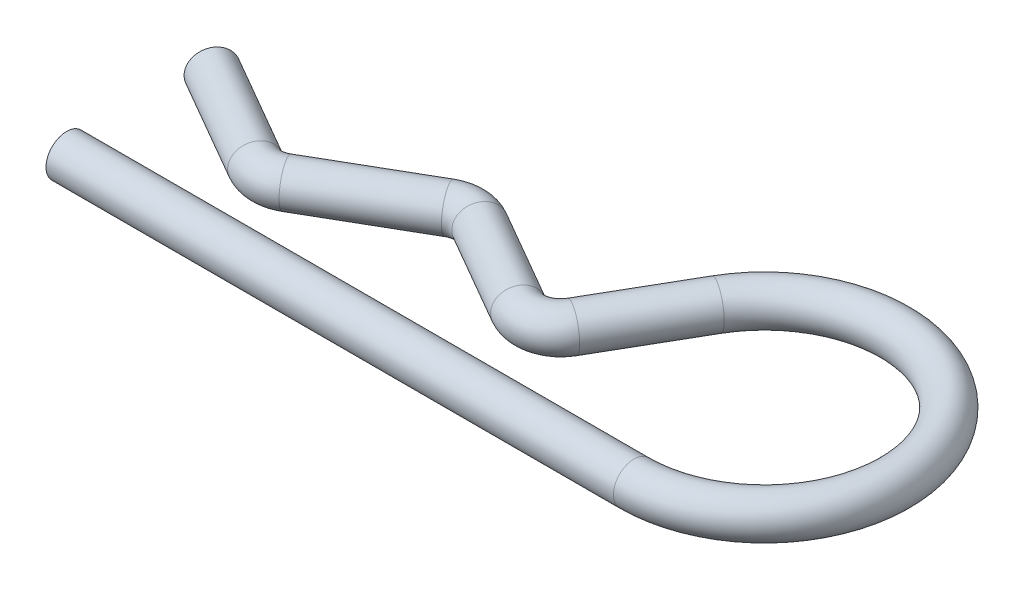
ISO-10303-21;
HEADER;
FILE_DESCRIPTION(('STEP AP214'),'2;1');
FILE_NAME('part.step','',(''),(''),'','','');
FILE_SCHEMA(('AUTOMOTIVE_DESIGN { 1 0 10303 214 1 1 1 1 }'));
ENDSEC;
DATA;
#1=APPLICATION_CONTEXT('core data for automotive mechanical design processes');
#2=APPLICATION_PROTOCOL_DEFINITION('international standard','automotive_design',2000,#1);
#3=PRODUCT_CONTEXT('',#1,'mechanical');
#4=PRODUCT('Part','Part','',(#3));
#5=PRODUCT_RELATED_PRODUCT_CATEGORY('part','',(#4));
#6=PRODUCT_DEFINITION_FORMATION('','',#4);
#7=PRODUCT_DEFINITION_CONTEXT('part definition',#1,'design');
#8=PRODUCT_DEFINITION('design','',#6,#7);
#9=PRODUCT_DEFINITION_SHAPE('','',#8);
#10=(LENGTH_UNIT() NAMED_UNIT(*) SI_UNIT(.MILLI.,.METRE.));
#11=(NAMED_UNIT(*) PLANE_ANGLE_UNIT() SI_UNIT($,.RADIAN.));
#12=(NAMED_UNIT(*) SI_UNIT($,.STERADIAN.) SOLID_ANGLE_UNIT());
#13=UNCERTAINTY_MEASURE_WITH_UNIT(LENGTH_MEASURE(1.E-05),#10,'distance_accuracy_value','');
#14=(GEOMETRIC_REPRESENTATION_CONTEXT(3) GLOBAL_UNCERTAINTY_ASSIGNED_CONTEXT((#13)) GLOBAL_UNIT_ASSIGNED_CONTEXT((#10,
#11,#12)) REPRESENTATION_CONTEXT('',''));
#15=CARTESIAN_POINT('',(0.,0.,0.));
#16=DIRECTION('',(0.,0.,1.));
#17=DIRECTION('',(1.,0.,0.));
#18=AXIS2_PLACEMENT_3D('',#15,#16,#17);
#19=CARTESIAN_POINT('',(-3.625,0.,-2.09289472581241));
#20=DIRECTION('',(-0.866025403784439,0.,-0.5));
#21=DIRECTION('',(-0.5,0.,0.866025403784439));
#22=AXIS2_PLACEMENT_3D('',#19,#20,#21);
#23=CYLINDRICAL_SURFACE('',#22,0.5);
#24=CARTESIAN_POINT('',(-3.625,0.,-2.09289472581241));
#25=DIRECTION('',(-0.866025403784445,0.,-0.499999999999989));
#26=DIRECTION('',(-0.499999999999989,0.,0.866025403784445));
#27=AXIS2_PLACEMENT_3D('',#24,#25,#26);
#28=CIRCLE('',#27,0.5);
#29=CARTESIAN_POINT('',(-3.87500000000001,0.,-1.65988202392018));
#30=VERTEX_POINT('',#29);
#31=EDGE_CURVE('E20',#30,#30,#28,.T.);
#32=ORIENTED_EDGE('',*,*,#31,.T.);
#33=EDGE_LOOP('',(#32));
#34=FACE_BOUND('',#33,.T.);
#35=CARTESIAN_POINT('',(-6.125,0.,-3.53627039878648));
#36=DIRECTION('',(-0.866025403784445,0.,-0.499999999999989));
#37=DIRECTION('',(-0.499999999999989,0.,0.866025403784445));
#38=AXIS2_PLACEMENT_3D('',#35,#36,#37);
#39=CIRCLE('',#38,0.5);
#40=CARTESIAN_POINT('',(-6.37499999999999,0.,-3.10325769689426));
#41=VERTEX_POINT('',#40);
#42=EDGE_CURVE('E10',#41,#41,#39,.T.);
#43=ORIENTED_EDGE('',*,*,#42,.F.);
#44=EDGE_LOOP('',(#43));
#45=FACE_BOUND('',#44,.T.);
#46=ADVANCED_FACE('F14',(#34,#45),#23,.T.);
#47=CARTESIAN_POINT('',(-3.25,0.,-2.74241377865073));
#48=DIRECTION('',(0.,-1.,0.));
#49=DIRECTION('',(0.,0.,-1.));
#50=AXIS2_PLACEMENT_3D('',#47,#48,#49);
#51=TOROIDAL_SURFACE('',#50,0.75,0.5);
#52=CARTESIAN_POINT('',(-2.87500000000004,0.,-2.09289472581237));
#53=DIRECTION('',(-0.866025403784432,0.,0.500000000000012));
#54=DIRECTION('',(0.500000000000012,0.,0.866025403784432));
#55=AXIS2_PLACEMENT_3D('',#52,#53,#54);
#56=CIRCLE('',#55,0.5);
#57=CARTESIAN_POINT('',(-2.62500000000006,0.,-1.65988202392014));
#58=VERTEX_POINT('',#57);
#59=EDGE_CURVE('E24',#58,#58,#56,.T.);
#60=CARTESIAN_POINT('',(-3.25,0.,-2.74241377865073));
#61=DIRECTION('',(0.,-1.,0.));
#62=DIRECTION('',(0.,0.,-1.));
#63=AXIS2_PLACEMENT_3D('',#60,#61,#62);
#64=CIRCLE('',#63,1.25);
#65=EDGE_CURVE('',#58,#30,#64,.T.);
#66=ORIENTED_EDGE('',*,*,#59,.T.);
#67=ORIENTED_EDGE('',*,*,#31,.F.);
#68=ORIENTED_EDGE('',*,*,#65,.T.);
#69=ORIENTED_EDGE('',*,*,#65,.F.);
#70=EDGE_LOOP('',(#66,#68,#67,#69));
#71=FACE_BOUND('',#70,.T.);
#72=ADVANCED_FACE('F71',(#71),#51,.T.);
#73=CARTESIAN_POINT('',(-0.375000000000034,0.,-3.53627039878644));
#74=DIRECTION('',(-0.866025403784439,0.,0.5));
#75=DIRECTION('',(0.5,0.,0.866025403784439));
#76=AXIS2_PLACEMENT_3D('',#73,#74,#75);
#77=CYLINDRICAL_SURFACE('',#76,0.5);
#78=CARTESIAN_POINT('',(-0.375000000000034,0.,-3.53627039878644));
#79=DIRECTION('',(-0.866025403784432,0.,0.500000000000012));
#80=DIRECTION('',(0.500000000000012,0.,0.866025403784432));
#81=AXIS2_PLACEMENT_3D('',#78,#79,#80);
#82=CIRCLE('',#81,0.5);
#83=CARTESIAN_POINT('',(-0.625000000000061,0.,-3.96928310067865));
#84=VERTEX_POINT('',#83);
#85=EDGE_CURVE('E28',#84,#84,#82,.T.);
#86=ORIENTED_EDGE('',*,*,#85,.T.);
#87=EDGE_LOOP('',(#86));
#88=FACE_BOUND('',#87,.T.);
#89=ORIENTED_EDGE('',*,*,#59,.F.);
#90=EDGE_LOOP('',(#89));
#91=FACE_BOUND('',#90,.T.);
#92=ADVANCED_FACE('F75',(#88,#91),#77,.T.);
#93=CARTESIAN_POINT('',(0.,0.,-2.88675134594813));
#94=DIRECTION('',(0.,1.,0.));
#95=DIRECTION('',(0.,0.,1.));
#96=AXIS2_PLACEMENT_3D('',#93,#94,#95);
#97=TOROIDAL_SURFACE('',#96,0.75,0.5);
#98=CARTESIAN_POINT('',(0.374999999999965,0.,-3.53627039878648));
#99=DIRECTION('',(-0.866025403784446,0.,-0.499999999999988));
#100=DIRECTION('',(-0.499999999999988,0.,0.866025403784446));
#101=AXIS2_PLACEMENT_3D('',#98,#99,#100);
#102=CIRCLE('',#101,0.5);
#103=CARTESIAN_POINT('',(0.624999999999944,0.,-3.96928310067872));
#104=VERTEX_POINT('',#103);
#105=EDGE_CURVE('E33',#104,#104,#102,.T.);
#106=CARTESIAN_POINT('',(0.,0.,-2.88675134594813));
#107=DIRECTION('',(0.,1.,0.));
#108=DIRECTION('',(0.,0.,1.));
#109=AXIS2_PLACEMENT_3D('',#106,#107,#108);
#110=CIRCLE('',#109,1.25);
#111=EDGE_CURVE('',#104,#84,#110,.T.);
#112=ORIENTED_EDGE('',*,*,#105,.T.);
#113=ORIENTED_EDGE('',*,*,#85,.F.);
#114=ORIENTED_EDGE('',*,*,#111,.T.);
#115=ORIENTED_EDGE('',*,*,#111,.F.);
#116=EDGE_LOOP('',(#112,#114,#113,#115));
#117=FACE_BOUND('',#116,.T.);
#118=ADVANCED_FACE('F81',(#117),#97,.T.);
#119=CARTESIAN_POINT('',(2.60048094716164,0.,-2.2513883748663));
#120=DIRECTION('',(-0.866025403784438,0.,-0.5));
#121=DIRECTION('',(-0.5,0.,0.866025403784438));
#122=AXIS2_PLACEMENT_3D('',#119,#120,#121);
#123=CYLINDRICAL_SURFACE('',#122,0.5);
#124=CARTESIAN_POINT('',(2.60048094716164,0.,-2.2513883748663));
#125=DIRECTION('',(-0.866025403784446,0.,-0.499999999999988));
#126=DIRECTION('',(-0.499999999999988,0.,0.866025403784446));
#127=AXIS2_PLACEMENT_3D('',#124,#125,#126);
#128=CIRCLE('',#127,0.5);
#129=CARTESIAN_POINT('',(2.35048094716161,0.,-1.8183756729741));
#130=VERTEX_POINT('',#129);
#131=EDGE_CURVE('E36',#130,#130,#128,.T.);
#132=ORIENTED_EDGE('',*,*,#131,.T.);
#133=EDGE_LOOP('',(#132));
#134=FACE_BOUND('',#133,.T.);
#135=ORIENTED_EDGE('',*,*,#105,.F.);
#136=EDGE_LOOP('',(#135));
#137=FACE_BOUND('',#136,.T.);
#138=ADVANCED_FACE('F88',(#134,#137),#123,.T.);
#139=CARTESIAN_POINT('',(2.97548094716167,0.,-2.90090742770461));
#140=DIRECTION('',(0.,-1.,0.));
#141=DIRECTION('',(0.,0.,-1.));
#142=AXIS2_PLACEMENT_3D('',#139,#140,#141);
#143=TOROIDAL_SURFACE('',#142,0.75,0.5);
#144=CARTESIAN_POINT('',(3.625,0.,-2.52590742770458));
#145=DIRECTION('',(-0.499999999999988,0.,0.866025403784446));
#146=DIRECTION('',(0.866025403784446,0.,0.499999999999988));
#147=AXIS2_PLACEMENT_3D('',#144,#145,#146);
#148=CIRCLE('',#147,0.5);
#149=CARTESIAN_POINT('',(4.0580127018922,0.,-2.27590742770457));
#150=VERTEX_POINT('',#149);
#151=EDGE_CURVE('E39',#150,#150,#148,.T.);
#152=CARTESIAN_POINT('',(2.97548094716167,0.,-2.90090742770461));
#153=DIRECTION('',(0.,-1.,0.));
#154=DIRECTION('',(0.,0.,-1.));
#155=AXIS2_PLACEMENT_3D('',#152,#153,#154);
#156=CIRCLE('',#155,1.25);
#157=EDGE_CURVE('',#150,#130,#156,.T.);
#158=ORIENTED_EDGE('',*,*,#151,.T.);
#159=ORIENTED_EDGE('',*,*,#131,.F.);
#160=ORIENTED_EDGE('',*,*,#157,.T.);
#161=ORIENTED_EDGE('',*,*,#157,.F.);
#162=EDGE_LOOP('',(#158,#160,#159,#161));
#163=FACE_BOUND('',#162,.T.);
#164=ADVANCED_FACE('F92',(#163),#143,.T.);
#165=CARTESIAN_POINT('',(4.90988202392016,0.,-4.75138837486625));
#166=DIRECTION('',(-0.5,0.,0.866025403784439));
#167=DIRECTION('',(0.866025403784439,0.,0.5));
#168=AXIS2_PLACEMENT_3D('',#165,#166,#167);
#169=CYLINDRICAL_SURFACE('',#168,0.5);
#170=CARTESIAN_POINT('',(4.90988202392016,0.,-4.75138837486625));
#171=DIRECTION('',(-0.499999999999988,0.,0.866025403784446));
#172=DIRECTION('',(0.866025403784446,0.,0.499999999999988));
#173=AXIS2_PLACEMENT_3D('',#170,#171,#172);
#174=CIRCLE('',#173,0.5);
#175=CARTESIAN_POINT('',(4.47686932202793,0.,-5.00138837486625));
#176=VERTEX_POINT('',#175);
#177=EDGE_CURVE('E42',#176,#176,#174,.T.);
#178=ORIENTED_EDGE('',*,*,#177,.T.);
#179=EDGE_LOOP('',(#178));
#180=FACE_BOUND('',#179,.T.);
#181=ORIENTED_EDGE('',*,*,#151,.F.);
#182=EDGE_LOOP('',(#181));
#183=FACE_BOUND('',#182,.T.);
#184=ADVANCED_FACE('F96',(#180,#183),#169,.T.);
#185=CARTESIAN_POINT('',(7.65309738117368,0.,-3.16759224991086));
#186=DIRECTION('',(0.,1.,0.));
#187=DIRECTION('',(0.,0.,1.));
#188=AXIS2_PLACEMENT_3D('',#185,#186,#187);
#189=TOROIDAL_SURFACE('',#188,3.16759224991086,0.5);
#190=CARTESIAN_POINT('',(7.65309738117368,0.,0.));
#191=DIRECTION('',(1.,0.,0.));
#192=DIRECTION('',(0.,0.,-1.));
#193=AXIS2_PLACEMENT_3D('',#190,#191,#192);
#194=CIRCLE('',#193,0.5);
#195=CARTESIAN_POINT('',(7.65309738117368,0.,0.5));
#196=VERTEX_POINT('',#195);
#197=EDGE_CURVE('E45',#196,#196,#194,.T.);
#198=CARTESIAN_POINT('',(7.65309738117368,0.,-3.16759224991086));
#199=DIRECTION('',(0.,1.,0.));
#200=DIRECTION('',(0.,0.,1.));
#201=AXIS2_PLACEMENT_3D('',#198,#199,#200);
#202=CIRCLE('',#201,3.66759224991086);
#203=EDGE_CURVE('',#196,#176,#202,.T.);
#204=ORIENTED_EDGE('',*,*,#197,.T.);
#205=ORIENTED_EDGE('',*,*,#177,.F.);
#206=ORIENTED_EDGE('',*,*,#203,.T.);
#207=ORIENTED_EDGE('',*,*,#203,.F.);
#208=EDGE_LOOP('',(#204,#206,#205,#207));
#209=FACE_BOUND('',#208,.T.);
#210=ADVANCED_FACE('F52',(#209),#189,.T.);
#211=CARTESIAN_POINT('',(7.65309738117368,0.,0.));
#212=DIRECTION('',(-1.,0.,0.));
#213=DIRECTION('',(0.,0.,1.));
#214=AXIS2_PLACEMENT_3D('',#211,#212,#213);
#215=CYLINDRICAL_SURFACE('',#214,0.5);
#216=ORIENTED_EDGE('',*,*,#197,.F.);
#217=EDGE_LOOP('',(#216));
#218=FACE_BOUND('',#217,.T.);
#219=CARTESIAN_POINT('',(-6.125,0.,0.));
#220=DIRECTION('',(1.,0.,0.));
#221=DIRECTION('',(0.,0.,-1.));
#222=AXIS2_PLACEMENT_3D('',#219,#220,#221);
#223=CIRCLE('',#222,0.5);
#224=CARTESIAN_POINT('',(-6.125,0.,-0.5));
#225=VERTEX_POINT('',#224);
#226=EDGE_CURVE('E46',#225,#225,#223,.T.);
#227=ORIENTED_EDGE('',*,*,#226,.T.);
#228=EDGE_LOOP('',(#227));
#229=FACE_BOUND('',#228,.T.);
#230=ADVANCED_FACE('F55',(#218,#229),#215,.T.);
#231=CARTESIAN_POINT('',(-6.125,0.,-3.53627039878648));
#232=DIRECTION('',(-0.866025403784445,0.,-0.499999999999989));
#233=DIRECTION('',(-0.499999999999989,0.,0.866025403784445));
#234=AXIS2_PLACEMENT_3D('',#231,#232,#233);
#235=PLANE('',#234);
#236=ORIENTED_EDGE('',*,*,#42,.T.);
#237=EDGE_LOOP('',(#236));
#238=FACE_BOUND('',#237,.T.);
#239=ADVANCED_FACE('F58',(#238),#235,.T.);
#240=CARTESIAN_POINT('',(-6.125,0.,0.));
#241=DIRECTION('',(1.,0.,0.));
#242=DIRECTION('',(0.,0.,-1.));
#243=AXIS2_PLACEMENT_3D('',#240,#241,#242);
#244=PLANE('',#243);
#245=ORIENTED_EDGE('',*,*,#226,.F.);
#246=EDGE_LOOP('',(#245));
#247=FACE_BOUND('',#246,.T.);
#248=ADVANCED_FACE('F62',(#247),#244,.F.);
#249=CLOSED_SHELL('',(#46,#72,#92,#118,#138,#164,#184,#210,#230,#239,#248));
#250=MANIFOLD_SOLID_BREP('B1',#249);
#251=ADVANCED_BREP_SHAPE_REPRESENTATION('',(#18,#250),#14);
#252=SHAPE_DEFINITION_REPRESENTATION(#9,#251);
ENDSEC;
END-ISO-10303-21;
